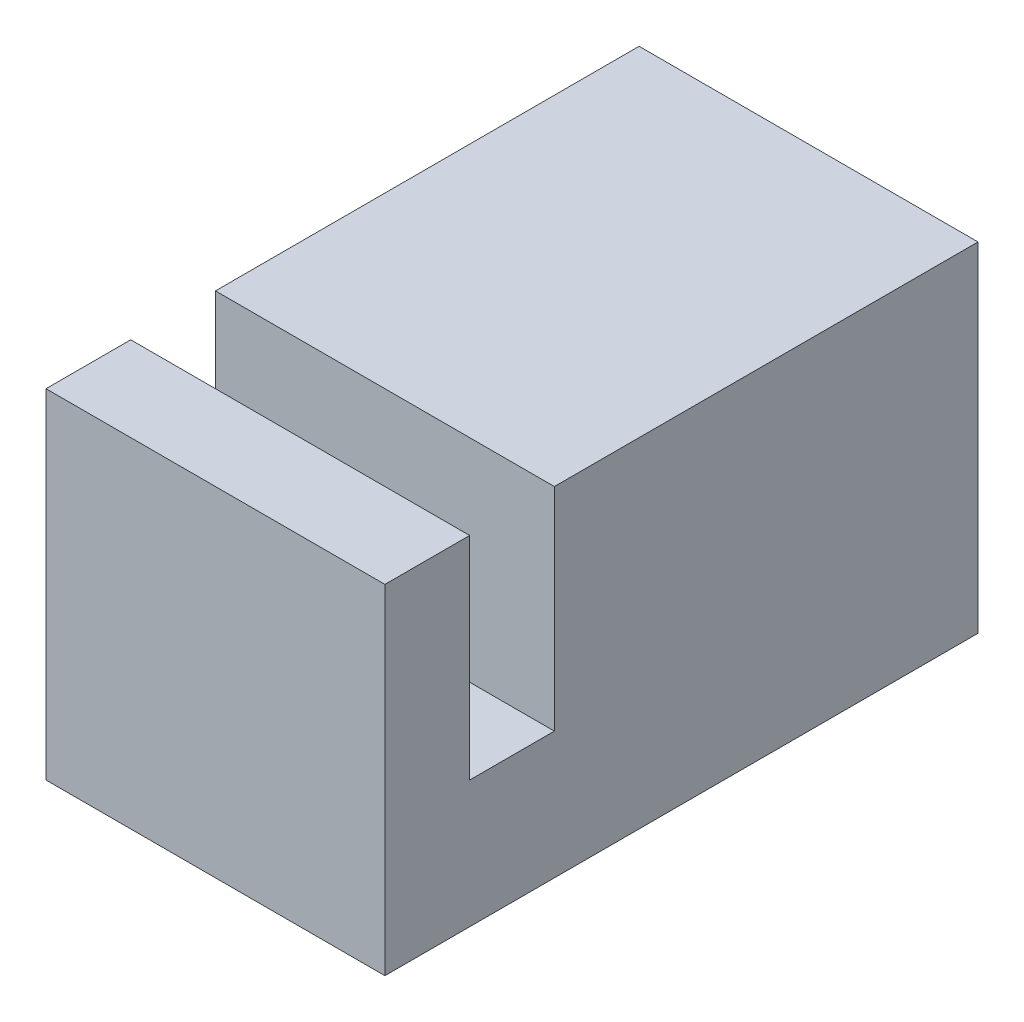
ISO-10303-21;
HEADER;
FILE_DESCRIPTION(('STEP AP214'),'2;1');
FILE_NAME('part.step','',(''),(''),'','','');
FILE_SCHEMA(('AUTOMOTIVE_DESIGN { 1 0 10303 214 1 1 1 1 }'));
ENDSEC;
DATA;
#1=APPLICATION_CONTEXT('core data for automotive mechanical design processes');
#2=APPLICATION_PROTOCOL_DEFINITION('international standard','automotive_design',2000,#1);
#3=PRODUCT_CONTEXT('',#1,'mechanical');
#4=PRODUCT('Part','Part','',(#3));
#5=PRODUCT_RELATED_PRODUCT_CATEGORY('part','',(#4));
#6=PRODUCT_DEFINITION_FORMATION('','',#4);
#7=PRODUCT_DEFINITION_CONTEXT('part definition',#1,'design');
#8=PRODUCT_DEFINITION('design','',#6,#7);
#9=PRODUCT_DEFINITION_SHAPE('','',#8);
#10=(LENGTH_UNIT() NAMED_UNIT(*) SI_UNIT(.MILLI.,.METRE.));
#11=(NAMED_UNIT(*) PLANE_ANGLE_UNIT() SI_UNIT($,.RADIAN.));
#12=(NAMED_UNIT(*) SI_UNIT($,.STERADIAN.) SOLID_ANGLE_UNIT());
#13=UNCERTAINTY_MEASURE_WITH_UNIT(LENGTH_MEASURE(1.E-05),#10,'distance_accuracy_value','');
#14=(GEOMETRIC_REPRESENTATION_CONTEXT(3) GLOBAL_UNCERTAINTY_ASSIGNED_CONTEXT((#13)) GLOBAL_UNIT_ASSIGNED_CONTEXT((#10,
#11,#12)) REPRESENTATION_CONTEXT('',''));
#15=CARTESIAN_POINT('',(0.,0.,0.));
#16=DIRECTION('',(0.,0.,1.));
#17=DIRECTION('',(1.,0.,0.));
#18=AXIS2_PLACEMENT_3D('',#15,#16,#17);
#19=CARTESIAN_POINT('',(0.,8.,14.));
#20=DIRECTION('',(0.,-1.,0.));
#21=DIRECTION('',(0.,0.,-1.));
#22=AXIS2_PLACEMENT_3D('',#19,#20,#21);
#23=PLANE('',#22);
#24=DIRECTION('',(0.,0.,-1.));
#25=VECTOR('',#24,1.);
#26=CARTESIAN_POINT('',(0.,8.,14.));
#27=LINE('',#26,#25);
#28=CARTESIAN_POINT('',(0.,8.,10.));
#29=VERTEX_POINT('',#28);
#30=CARTESIAN_POINT('',(0.,8.,0.));
#31=VERTEX_POINT('',#30);
#32=EDGE_CURVE('E83',#29,#31,#27,.T.);
#33=ORIENTED_EDGE('',*,*,#32,.F.);
#34=DIRECTION('',(-1.,0.,0.));
#35=VECTOR('',#34,1.);
#36=CARTESIAN_POINT('',(0.,8.,10.));
#37=LINE('',#36,#35);
#38=CARTESIAN_POINT('',(8.,8.,10.));
#39=VERTEX_POINT('',#38);
#40=EDGE_CURVE('E125',#39,#29,#37,.T.);
#41=ORIENTED_EDGE('',*,*,#40,.F.);
#42=DIRECTION('',(0.,0.,-1.));
#43=VECTOR('',#42,1.);
#44=CARTESIAN_POINT('',(8.,8.,14.));
#45=LINE('',#44,#43);
#46=CARTESIAN_POINT('',(8.,8.,0.));
#47=VERTEX_POINT('',#46);
#48=EDGE_CURVE('E153',#39,#47,#45,.T.);
#49=ORIENTED_EDGE('',*,*,#48,.T.);
#50=DIRECTION('',(-1.,0.,0.));
#51=VECTOR('',#50,1.);
#52=CARTESIAN_POINT('',(0.,8.,0.));
#53=LINE('',#52,#51);
#54=EDGE_CURVE('E138',#47,#31,#53,.T.);
#55=ORIENTED_EDGE('',*,*,#54,.T.);
#56=EDGE_LOOP('',(#33,#41,#49,#55));
#57=FACE_BOUND('',#56,.T.);
#58=ADVANCED_FACE('F37',(#57),#23,.F.);
#59=CARTESIAN_POINT('',(0.,0.,14.));
#60=DIRECTION('',(1.,0.,0.));
#61=DIRECTION('',(0.,0.,-1.));
#62=AXIS2_PLACEMENT_3D('',#59,#60,#61);
#63=PLANE('',#62);
#64=DIRECTION('',(0.,0.,1.));
#65=VECTOR('',#64,1.);
#66=CARTESIAN_POINT('',(0.,3.,10.));
#67=LINE('',#66,#65);
#68=CARTESIAN_POINT('',(0.,3.,10.));
#69=VERTEX_POINT('',#68);
#70=CARTESIAN_POINT('',(0.,3.,12.));
#71=VERTEX_POINT('',#70);
#72=EDGE_CURVE('E119',#69,#71,#67,.T.);
#73=ORIENTED_EDGE('',*,*,#72,.F.);
#74=DIRECTION('',(0.,1.,0.));
#75=VECTOR('',#74,1.);
#76=CARTESIAN_POINT('',(0.,3.,10.));
#77=LINE('',#76,#75);
#78=EDGE_CURVE('E146',#69,#29,#77,.T.);
#79=ORIENTED_EDGE('',*,*,#78,.T.);
#80=ORIENTED_EDGE('',*,*,#32,.T.);
#81=DIRECTION('',(0.,-1.,0.));
#82=VECTOR('',#81,1.);
#83=CARTESIAN_POINT('',(0.,0.,0.));
#84=LINE('',#83,#82);
#85=CARTESIAN_POINT('',(0.,0.,0.));
#86=VERTEX_POINT('',#85);
#87=EDGE_CURVE('E143',#31,#86,#84,.T.);
#88=ORIENTED_EDGE('',*,*,#87,.T.);
#89=DIRECTION('',(0.,0.,-1.));
#90=VECTOR('',#89,1.);
#91=CARTESIAN_POINT('',(0.,0.,14.));
#92=LINE('',#91,#90);
#93=CARTESIAN_POINT('',(0.,0.,14.));
#94=VERTEX_POINT('',#93);
#95=EDGE_CURVE('E11',#94,#86,#92,.T.);
#96=ORIENTED_EDGE('',*,*,#95,.F.);
#97=DIRECTION('',(0.,-1.,0.));
#98=VECTOR('',#97,1.);
#99=CARTESIAN_POINT('',(0.,0.,14.));
#100=LINE('',#99,#98);
#101=CARTESIAN_POINT('',(0.,8.,14.));
#102=VERTEX_POINT('',#101);
#103=EDGE_CURVE('E136',#102,#94,#100,.T.);
#104=ORIENTED_EDGE('',*,*,#103,.F.);
#105=CARTESIAN_POINT('',(0.,8.,12.));
#106=VERTEX_POINT('',#105);
#107=EDGE_CURVE('E129',#102,#106,#27,.T.);
#108=ORIENTED_EDGE('',*,*,#107,.T.);
#109=DIRECTION('',(0.,1.,0.));
#110=VECTOR('',#109,1.);
#111=CARTESIAN_POINT('',(0.,3.,12.));
#112=LINE('',#111,#110);
#113=EDGE_CURVE('E52',#71,#106,#112,.T.);
#114=ORIENTED_EDGE('',*,*,#113,.F.);
#115=EDGE_LOOP('',(#73,#79,#80,#88,#96,#104,#108,#114));
#116=FACE_BOUND('',#115,.T.);
#117=ADVANCED_FACE('F39',(#116),#63,.F.);
#118=CARTESIAN_POINT('',(0.,0.,14.));
#119=DIRECTION('',(0.,1.,0.));
#120=DIRECTION('',(0.,0.,1.));
#121=AXIS2_PLACEMENT_3D('',#118,#119,#120);
#122=PLANE('',#121);
#123=DIRECTION('',(1.,0.,0.));
#124=VECTOR('',#123,1.);
#125=CARTESIAN_POINT('',(0.,0.,0.));
#126=LINE('',#125,#124);
#127=CARTESIAN_POINT('',(8.,0.,0.));
#128=VERTEX_POINT('',#127);
#129=EDGE_CURVE('E145',#86,#128,#126,.T.);
#130=ORIENTED_EDGE('',*,*,#129,.T.);
#131=DIRECTION('',(0.,0.,-1.));
#132=VECTOR('',#131,1.);
#133=CARTESIAN_POINT('',(8.,0.,14.));
#134=LINE('',#133,#132);
#135=CARTESIAN_POINT('',(8.,0.,14.));
#136=VERTEX_POINT('',#135);
#137=EDGE_CURVE('E45',#136,#128,#134,.T.);
#138=ORIENTED_EDGE('',*,*,#137,.F.);
#139=DIRECTION('',(1.,0.,0.));
#140=VECTOR('',#139,1.);
#141=CARTESIAN_POINT('',(0.,0.,14.));
#142=LINE('',#141,#140);
#143=EDGE_CURVE('E90',#94,#136,#142,.T.);
#144=ORIENTED_EDGE('',*,*,#143,.F.);
#145=ORIENTED_EDGE('',*,*,#95,.T.);
#146=EDGE_LOOP('',(#130,#138,#144,#145));
#147=FACE_BOUND('',#146,.T.);
#148=ADVANCED_FACE('F208',(#147),#122,.F.);
#149=CARTESIAN_POINT('',(8.,0.,14.));
#150=DIRECTION('',(-1.,0.,0.));
#151=DIRECTION('',(0.,0.,1.));
#152=AXIS2_PLACEMENT_3D('',#149,#150,#151);
#153=PLANE('',#152);
#154=ORIENTED_EDGE('',*,*,#48,.F.);
#155=DIRECTION('',(0.,1.,0.));
#156=VECTOR('',#155,1.);
#157=CARTESIAN_POINT('',(8.,3.,10.));
#158=LINE('',#157,#156);
#159=CARTESIAN_POINT('',(8.,3.,10.));
#160=VERTEX_POINT('',#159);
#161=EDGE_CURVE('E131',#160,#39,#158,.T.);
#162=ORIENTED_EDGE('',*,*,#161,.F.);
#163=DIRECTION('',(0.,0.,-1.));
#164=VECTOR('',#163,1.);
#165=CARTESIAN_POINT('',(8.,3.,10.));
#166=LINE('',#165,#164);
#167=CARTESIAN_POINT('',(8.,3.,12.));
#168=VERTEX_POINT('',#167);
#169=EDGE_CURVE('E118',#168,#160,#166,.T.);
#170=ORIENTED_EDGE('',*,*,#169,.F.);
#171=DIRECTION('',(0.,1.,0.));
#172=VECTOR('',#171,1.);
#173=CARTESIAN_POINT('',(8.,3.,12.));
#174=LINE('',#173,#172);
#175=CARTESIAN_POINT('',(8.,8.,12.));
#176=VERTEX_POINT('',#175);
#177=EDGE_CURVE('E114',#168,#176,#174,.T.);
#178=ORIENTED_EDGE('',*,*,#177,.T.);
#179=CARTESIAN_POINT('',(8.,8.,14.));
#180=VERTEX_POINT('',#179);
#181=EDGE_CURVE('E154',#180,#176,#45,.T.);
#182=ORIENTED_EDGE('',*,*,#181,.F.);
#183=DIRECTION('',(0.,1.,0.));
#184=VECTOR('',#183,1.);
#185=CARTESIAN_POINT('',(8.,0.,14.));
#186=LINE('',#185,#184);
#187=EDGE_CURVE('E140',#136,#180,#186,.T.);
#188=ORIENTED_EDGE('',*,*,#187,.F.);
#189=ORIENTED_EDGE('',*,*,#137,.T.);
#190=DIRECTION('',(0.,1.,0.));
#191=VECTOR('',#190,1.);
#192=CARTESIAN_POINT('',(8.,0.,0.));
#193=LINE('',#192,#191);
#194=EDGE_CURVE('E148',#128,#47,#193,.T.);
#195=ORIENTED_EDGE('',*,*,#194,.T.);
#196=EDGE_LOOP('',(#154,#162,#170,#178,#182,#188,#189,#195));
#197=FACE_BOUND('',#196,.T.);
#198=ADVANCED_FACE('F161',(#197),#153,.F.);
#199=ORIENTED_EDGE('',*,*,#181,.T.);
#200=DIRECTION('',(1.,0.,0.));
#201=VECTOR('',#200,1.);
#202=CARTESIAN_POINT('',(8.,8.,12.));
#203=LINE('',#202,#201);
#204=EDGE_CURVE('E174',#106,#176,#203,.T.);
#205=ORIENTED_EDGE('',*,*,#204,.F.);
#206=ORIENTED_EDGE('',*,*,#107,.F.);
#207=DIRECTION('',(-1.,0.,0.));
#208=VECTOR('',#207,1.);
#209=CARTESIAN_POINT('',(0.,8.,14.));
#210=LINE('',#209,#208);
#211=EDGE_CURVE('E61',#180,#102,#210,.T.);
#212=ORIENTED_EDGE('',*,*,#211,.F.);
#213=EDGE_LOOP('',(#199,#205,#206,#212));
#214=FACE_BOUND('',#213,.T.);
#215=ADVANCED_FACE('F201',(#214),#23,.F.);
#216=CARTESIAN_POINT('',(0.,0.,14.));
#217=DIRECTION('',(0.,0.,-1.));
#218=DIRECTION('',(-1.,0.,0.));
#219=AXIS2_PLACEMENT_3D('',#216,#217,#218);
#220=PLANE('',#219);
#221=ORIENTED_EDGE('',*,*,#103,.T.);
#222=ORIENTED_EDGE('',*,*,#143,.T.);
#223=ORIENTED_EDGE('',*,*,#187,.T.);
#224=ORIENTED_EDGE('',*,*,#211,.T.);
#225=EDGE_LOOP('',(#221,#222,#223,#224));
#226=FACE_BOUND('',#225,.T.);
#227=ADVANCED_FACE('F194',(#226),#220,.F.);
#228=CARTESIAN_POINT('',(0.,0.,0.));
#229=DIRECTION('',(0.,0.,-1.));
#230=DIRECTION('',(-1.,0.,0.));
#231=AXIS2_PLACEMENT_3D('',#228,#229,#230);
#232=PLANE('',#231);
#233=CARTESIAN_POINT('',(4.,4.,0.));
#234=DIRECTION('',(0.,0.,-1.));
#235=DIRECTION('',(-1.,0.,0.));
#236=AXIS2_PLACEMENT_3D('',#233,#234,#235);
#237=CIRCLE('',#236,1.375);
#238=CARTESIAN_POINT('',(2.625,4.,0.));
#239=VERTEX_POINT('',#238);
#240=EDGE_CURVE('E178',#239,#239,#237,.T.);
#241=ORIENTED_EDGE('',*,*,#240,.F.);
#242=EDGE_LOOP('',(#241));
#243=FACE_BOUND('',#242,.T.);
#244=ORIENTED_EDGE('',*,*,#87,.F.);
#245=ORIENTED_EDGE('',*,*,#54,.F.);
#246=ORIENTED_EDGE('',*,*,#194,.F.);
#247=ORIENTED_EDGE('',*,*,#129,.F.);
#248=EDGE_LOOP('',(#244,#245,#246,#247));
#249=FACE_BOUND('',#248,.T.);
#250=ADVANCED_FACE('F166',(#243,#249),#232,.T.);
#251=CARTESIAN_POINT('',(0.,3.,10.));
#252=DIRECTION('',(0.,0.,-1.));
#253=DIRECTION('',(-1.,0.,0.));
#254=AXIS2_PLACEMENT_3D('',#251,#252,#253);
#255=PLANE('',#254);
#256=ORIENTED_EDGE('',*,*,#40,.T.);
#257=ORIENTED_EDGE('',*,*,#78,.F.);
#258=DIRECTION('',(-1.,0.,0.));
#259=VECTOR('',#258,1.);
#260=CARTESIAN_POINT('',(5.,3.,10.));
#261=LINE('',#260,#259);
#262=EDGE_CURVE('E123',#160,#69,#261,.T.);
#263=ORIENTED_EDGE('',*,*,#262,.F.);
#264=ORIENTED_EDGE('',*,*,#161,.T.);
#265=EDGE_LOOP('',(#256,#257,#263,#264));
#266=FACE_BOUND('',#265,.T.);
#267=ADVANCED_FACE('F193',(#266),#255,.F.);
#268=CARTESIAN_POINT('',(8.,3.,12.));
#269=DIRECTION('',(0.,0.,1.));
#270=DIRECTION('',(1.,0.,0.));
#271=AXIS2_PLACEMENT_3D('',#268,#269,#270);
#272=PLANE('',#271);
#273=ORIENTED_EDGE('',*,*,#204,.T.);
#274=ORIENTED_EDGE('',*,*,#177,.F.);
#275=DIRECTION('',(1.,0.,0.));
#276=VECTOR('',#275,1.);
#277=CARTESIAN_POINT('',(0.,3.,12.));
#278=LINE('',#277,#276);
#279=EDGE_CURVE('E110',#71,#168,#278,.T.);
#280=ORIENTED_EDGE('',*,*,#279,.F.);
#281=ORIENTED_EDGE('',*,*,#113,.T.);
#282=EDGE_LOOP('',(#273,#274,#280,#281));
#283=FACE_BOUND('',#282,.T.);
#284=ADVANCED_FACE('F112',(#283),#272,.F.);
#285=CARTESIAN_POINT('',(0.,3.,0.));
#286=DIRECTION('',(0.,1.,0.));
#287=DIRECTION('',(0.,0.,1.));
#288=AXIS2_PLACEMENT_3D('',#285,#286,#287);
#289=PLANE('',#288);
#290=ORIENTED_EDGE('',*,*,#72,.T.);
#291=ORIENTED_EDGE('',*,*,#279,.T.);
#292=ORIENTED_EDGE('',*,*,#169,.T.);
#293=ORIENTED_EDGE('',*,*,#262,.T.);
#294=EDGE_LOOP('',(#290,#291,#292,#293));
#295=FACE_BOUND('',#294,.T.);
#296=ADVANCED_FACE('F122',(#295),#289,.T.);
#297=CARTESIAN_POINT('',(4.,4.,9.));
#298=DIRECTION('',(0.,0.,-1.));
#299=DIRECTION('',(-1.,0.,0.));
#300=AXIS2_PLACEMENT_3D('',#297,#298,#299);
#301=CYLINDRICAL_SURFACE('',#300,1.375);
#302=CARTESIAN_POINT('',(4.,4.,9.));
#303=DIRECTION('',(0.,0.,-1.));
#304=DIRECTION('',(-1.,0.,0.));
#305=AXIS2_PLACEMENT_3D('',#302,#303,#304);
#306=CIRCLE('',#305,1.375);
#307=CARTESIAN_POINT('',(2.625,4.,9.));
#308=VERTEX_POINT('',#307);
#309=EDGE_CURVE('E175',#308,#308,#306,.T.);
#310=ORIENTED_EDGE('',*,*,#309,.F.);
#311=EDGE_LOOP('',(#310));
#312=FACE_BOUND('',#311,.T.);
#313=ORIENTED_EDGE('',*,*,#240,.T.);
#314=EDGE_LOOP('',(#313));
#315=FACE_BOUND('',#314,.T.);
#316=ADVANCED_FACE('F186',(#312,#315),#301,.F.);
#317=CARTESIAN_POINT('',(4.,4.,9.));
#318=DIRECTION('',(0.,0.,-1.));
#319=DIRECTION('',(-1.,0.,0.));
#320=AXIS2_PLACEMENT_3D('',#317,#318,#319);
#321=PLANE('',#320);
#322=ORIENTED_EDGE('',*,*,#309,.T.);
#323=EDGE_LOOP('',(#322));
#324=FACE_BOUND('',#323,.T.);
#325=ADVANCED_FACE('F184',(#324),#321,.T.);
#326=CLOSED_SHELL('',(#58,#117,#148,#198,#215,#227,#250,#267,#284,#296,#316,#325));
#327=MANIFOLD_SOLID_BREP('B2',#326);
#328=ADVANCED_BREP_SHAPE_REPRESENTATION('',(#18,#327),#14);
#329=SHAPE_DEFINITION_REPRESENTATION(#9,#328);
ENDSEC;
END-ISO-10303-21;
